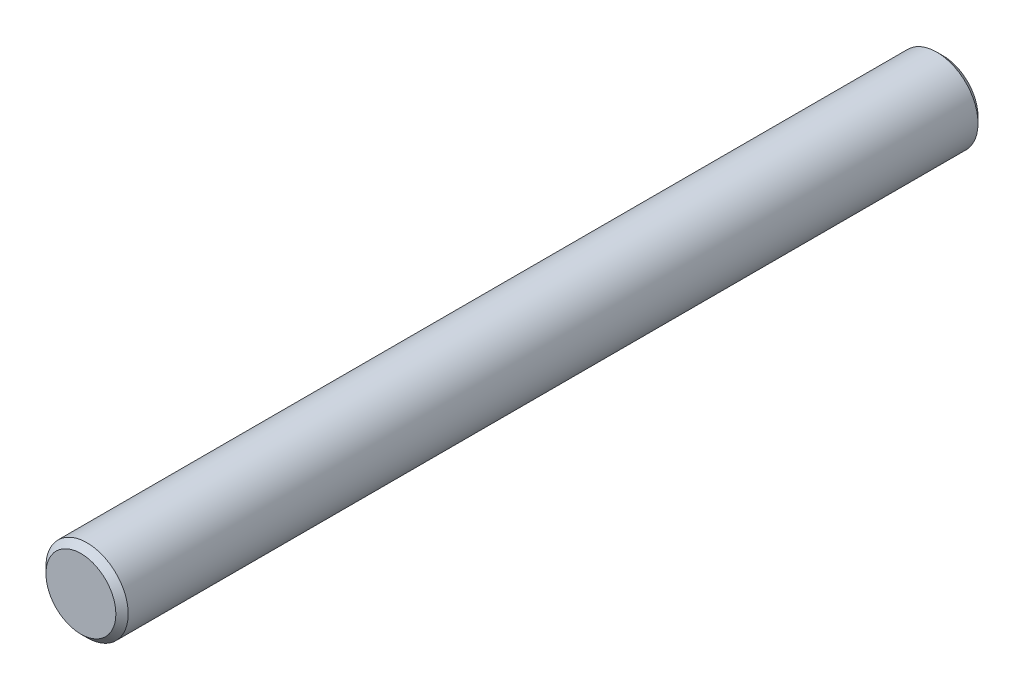
ISO-10303-21;
HEADER;
FILE_DESCRIPTION(('STEP AP214'),'2;1');
FILE_NAME('part.step','',(''),(''),'','','');
FILE_SCHEMA(('AUTOMOTIVE_DESIGN { 1 0 10303 214 1 1 1 1 }'));
ENDSEC;
DATA;
#1=APPLICATION_CONTEXT('core data for automotive mechanical design processes');
#2=APPLICATION_PROTOCOL_DEFINITION('international standard','automotive_design',2000,#1);
#3=PRODUCT_CONTEXT('',#1,'mechanical');
#4=PRODUCT('Part','Part','',(#3));
#5=PRODUCT_RELATED_PRODUCT_CATEGORY('part','',(#4));
#6=PRODUCT_DEFINITION_FORMATION('','',#4);
#7=PRODUCT_DEFINITION_CONTEXT('part definition',#1,'design');
#8=PRODUCT_DEFINITION('design','',#6,#7);
#9=PRODUCT_DEFINITION_SHAPE('','',#8);
#10=(LENGTH_UNIT() NAMED_UNIT(*) SI_UNIT(.MILLI.,.METRE.));
#11=(NAMED_UNIT(*) PLANE_ANGLE_UNIT() SI_UNIT($,.RADIAN.));
#12=(NAMED_UNIT(*) SI_UNIT($,.STERADIAN.) SOLID_ANGLE_UNIT());
#13=UNCERTAINTY_MEASURE_WITH_UNIT(LENGTH_MEASURE(1.E-05),#10,'distance_accuracy_value','');
#14=(GEOMETRIC_REPRESENTATION_CONTEXT(3) GLOBAL_UNCERTAINTY_ASSIGNED_CONTEXT((#13)) GLOBAL_UNIT_ASSIGNED_CONTEXT((#10,
#11,#12)) REPRESENTATION_CONTEXT('',''));
#15=CARTESIAN_POINT('',(0.,0.,0.));
#16=DIRECTION('',(0.,0.,1.));
#17=DIRECTION('',(1.,0.,0.));
#18=AXIS2_PLACEMENT_3D('',#15,#16,#17);
#19=CARTESIAN_POINT('',(0.,0.,41.5925));
#20=DIRECTION('',(0.,0.,-1.));
#21=DIRECTION('',(-1.,0.,0.));
#22=AXIS2_PLACEMENT_3D('',#19,#20,#21);
#23=CYLINDRICAL_SURFACE('',#22,3.96874999999989);
#24=CARTESIAN_POINT('',(0.,0.,-40.9971875));
#25=DIRECTION('',(0.,0.,1.));
#26=DIRECTION('',(1.,0.,0.));
#27=AXIS2_PLACEMENT_3D('',#24,#25,#26);
#28=CIRCLE('',#27,3.96874999999989);
#29=CARTESIAN_POINT('',(3.96874999999989,0.,-40.9971875));
#30=VERTEX_POINT('',#29);
#31=EDGE_CURVE('E43',#30,#30,#28,.T.);
#32=ORIENTED_EDGE('',*,*,#31,.T.);
#33=EDGE_LOOP('',(#32));
#34=FACE_BOUND('',#33,.T.);
#35=CARTESIAN_POINT('',(0.,0.,40.9971875));
#36=DIRECTION('',(0.,0.,1.));
#37=DIRECTION('',(1.,0.,0.));
#38=AXIS2_PLACEMENT_3D('',#35,#36,#37);
#39=CIRCLE('',#38,3.96874999999989);
#40=CARTESIAN_POINT('',(3.96874999999989,0.,40.9971875));
#41=VERTEX_POINT('',#40);
#42=EDGE_CURVE('E47',#41,#41,#39,.F.);
#43=ORIENTED_EDGE('',*,*,#42,.T.);
#44=EDGE_LOOP('',(#43));
#45=FACE_BOUND('',#44,.T.);
#46=ADVANCED_FACE('F32',(#34,#45),#23,.T.);
#47=CARTESIAN_POINT('',(0.,0.,41.5925));
#48=DIRECTION('',(0.,0.,1.));
#49=DIRECTION('',(1.,0.,0.));
#50=AXIS2_PLACEMENT_3D('',#47,#48,#49);
#51=PLANE('',#50);
#52=CARTESIAN_POINT('',(0.,0.,41.5925));
#53=DIRECTION('',(0.,0.,1.));
#54=DIRECTION('',(1.,0.,0.));
#55=AXIS2_PLACEMENT_3D('',#52,#53,#54);
#56=CIRCLE('',#55,3.37343749999989);
#57=CARTESIAN_POINT('',(3.37343749999989,0.,41.5925));
#58=VERTEX_POINT('',#57);
#59=EDGE_CURVE('E10',#58,#58,#56,.T.);
#60=ORIENTED_EDGE('',*,*,#59,.T.);
#61=EDGE_LOOP('',(#60));
#62=FACE_BOUND('',#61,.T.);
#63=ADVANCED_FACE('F63',(#62),#51,.T.);
#64=CARTESIAN_POINT('',(0.,0.,-41.5925));
#65=DIRECTION('',(0.,0.,1.));
#66=DIRECTION('',(1.,0.,0.));
#67=AXIS2_PLACEMENT_3D('',#64,#65,#66);
#68=PLANE('',#67);
#69=CARTESIAN_POINT('',(0.,0.,-41.5925));
#70=DIRECTION('',(0.,0.,1.));
#71=DIRECTION('',(1.,0.,0.));
#72=AXIS2_PLACEMENT_3D('',#69,#70,#71);
#73=CIRCLE('',#72,3.37343749999988);
#74=CARTESIAN_POINT('',(3.37343749999988,0.,-41.5925));
#75=VERTEX_POINT('',#74);
#76=EDGE_CURVE('E39',#75,#75,#73,.F.);
#77=ORIENTED_EDGE('',*,*,#76,.T.);
#78=EDGE_LOOP('',(#77));
#79=FACE_BOUND('',#78,.T.);
#80=ADVANCED_FACE('F60',(#79),#68,.F.);
#81=CARTESIAN_POINT('',(0.,0.,-40.9971875));
#82=DIRECTION('',(0.,0.,1.));
#83=DIRECTION('',(1.,0.,0.));
#84=AXIS2_PLACEMENT_3D('',#81,#82,#83);
#85=CONICAL_SURFACE('',#84,3.96874999999989,0.785398163397445);
#86=ORIENTED_EDGE('',*,*,#76,.F.);
#87=EDGE_LOOP('',(#86));
#88=FACE_BOUND('',#87,.T.);
#89=ORIENTED_EDGE('',*,*,#31,.F.);
#90=EDGE_LOOP('',(#89));
#91=FACE_BOUND('',#90,.T.);
#92=ADVANCED_FACE('F56',(#88,#91),#85,.T.);
#93=CARTESIAN_POINT('',(0.,0.,41.5925));
#94=DIRECTION('',(0.,0.,-1.));
#95=DIRECTION('',(-1.,0.,0.));
#96=AXIS2_PLACEMENT_3D('',#93,#94,#95);
#97=CONICAL_SURFACE('',#96,3.37343749999989,0.78539816339744);
#98=ORIENTED_EDGE('',*,*,#42,.F.);
#99=EDGE_LOOP('',(#98));
#100=FACE_BOUND('',#99,.T.);
#101=ORIENTED_EDGE('',*,*,#59,.F.);
#102=EDGE_LOOP('',(#101));
#103=FACE_BOUND('',#102,.T.);
#104=ADVANCED_FACE('F34',(#100,#103),#97,.T.);
#105=CLOSED_SHELL('',(#46,#63,#80,#92,#104));
#106=MANIFOLD_SOLID_BREP('B2',#105);
#107=ADVANCED_BREP_SHAPE_REPRESENTATION('',(#18,#106),#14);
#108=SHAPE_DEFINITION_REPRESENTATION(#9,#107);
ENDSEC;
END-ISO-10303-21;
